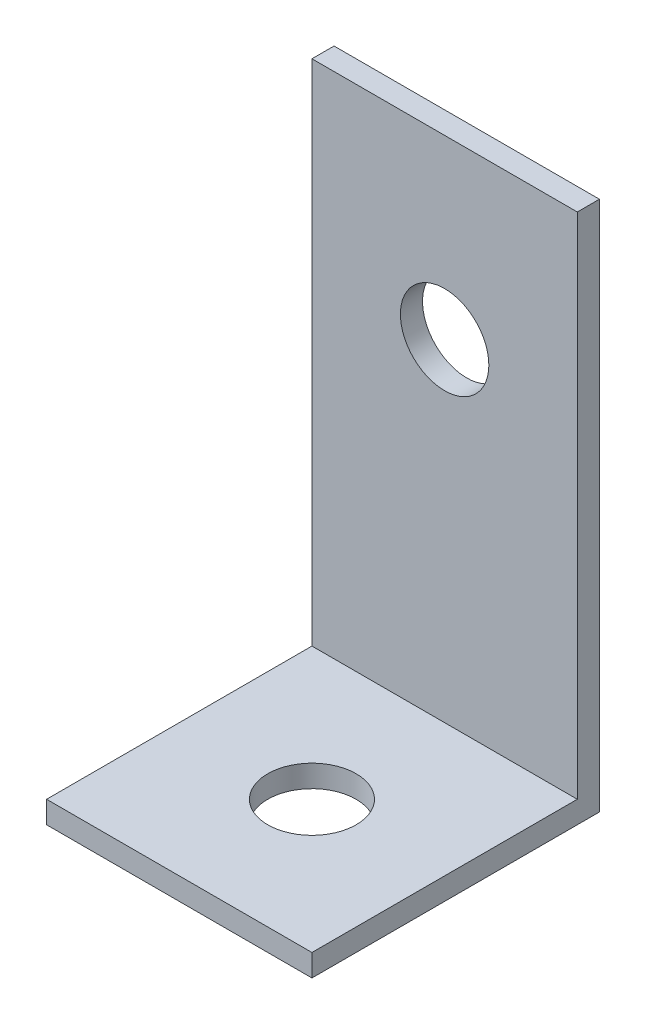
ISO-10303-21;
HEADER;
FILE_DESCRIPTION(('STEP AP214'),'2;1');
FILE_NAME('part.step','',(''),(''),'','','');
FILE_SCHEMA(('AUTOMOTIVE_DESIGN { 1 0 10303 214 1 1 1 1 }'));
ENDSEC;
DATA;
#1=APPLICATION_CONTEXT('core data for automotive mechanical design processes');
#2=APPLICATION_PROTOCOL_DEFINITION('international standard','automotive_design',2000,#1);
#3=PRODUCT_CONTEXT('',#1,'mechanical');
#4=PRODUCT('Part','Part','',(#3));
#5=PRODUCT_RELATED_PRODUCT_CATEGORY('part','',(#4));
#6=PRODUCT_DEFINITION_FORMATION('','',#4);
#7=PRODUCT_DEFINITION_CONTEXT('part definition',#1,'design');
#8=PRODUCT_DEFINITION('design','',#6,#7);
#9=PRODUCT_DEFINITION_SHAPE('','',#8);
#10=(LENGTH_UNIT() NAMED_UNIT(*) SI_UNIT(.MILLI.,.METRE.));
#11=(NAMED_UNIT(*) PLANE_ANGLE_UNIT() SI_UNIT($,.RADIAN.));
#12=(NAMED_UNIT(*) SI_UNIT($,.STERADIAN.) SOLID_ANGLE_UNIT());
#13=UNCERTAINTY_MEASURE_WITH_UNIT(LENGTH_MEASURE(1.E-05),#10,'distance_accuracy_value','');
#14=(GEOMETRIC_REPRESENTATION_CONTEXT(3) GLOBAL_UNCERTAINTY_ASSIGNED_CONTEXT((#13)) GLOBAL_UNIT_ASSIGNED_CONTEXT((#10,
#11,#12)) REPRESENTATION_CONTEXT('',''));
#15=CARTESIAN_POINT('',(0.,0.,0.));
#16=DIRECTION('',(0.,0.,1.));
#17=DIRECTION('',(1.,0.,0.));
#18=AXIS2_PLACEMENT_3D('',#15,#16,#17);
#19=CARTESIAN_POINT('',(0.,0.,0.79375));
#20=DIRECTION('',(0.,0.,1.));
#21=DIRECTION('',(1.,0.,0.));
#22=AXIS2_PLACEMENT_3D('',#19,#20,#21);
#23=PLANE('',#22);
#24=CARTESIAN_POINT('',(0.,6.35,0.79375));
#25=DIRECTION('',(0.,0.,1.));
#26=DIRECTION('',(1.,0.,0.));
#27=AXIS2_PLACEMENT_3D('',#24,#25,#26);
#28=CIRCLE('',#27,3.175);
#29=CARTESIAN_POINT('',(3.175,6.35,0.79375));
#30=VERTEX_POINT('',#29);
#31=EDGE_CURVE('E115',#30,#30,#28,.T.);
#32=ORIENTED_EDGE('',*,*,#31,.F.);
#33=EDGE_LOOP('',(#32));
#34=FACE_BOUND('',#33,.T.);
#35=DIRECTION('',(0.,-1.,0.));
#36=VECTOR('',#35,1.);
#37=CARTESIAN_POINT('',(-9.525,19.05,0.79375));
#38=LINE('',#37,#36);
#39=CARTESIAN_POINT('',(-9.525,19.05,0.79375));
#40=VERTEX_POINT('',#39);
#41=CARTESIAN_POINT('',(-9.52499999999999,-17.4625,0.79375));
#42=VERTEX_POINT('',#41);
#43=EDGE_CURVE('E109',#40,#42,#38,.T.);
#44=ORIENTED_EDGE('',*,*,#43,.T.);
#45=DIRECTION('',(1.,0.,0.));
#46=VECTOR('',#45,1.);
#47=CARTESIAN_POINT('',(-9.52499999999999,-17.4625,0.79375));
#48=LINE('',#47,#46);
#49=CARTESIAN_POINT('',(9.525,-17.4625,0.79375));
#50=VERTEX_POINT('',#49);
#51=EDGE_CURVE('E163',#42,#50,#48,.T.);
#52=ORIENTED_EDGE('',*,*,#51,.T.);
#53=DIRECTION('',(0.,1.,0.));
#54=VECTOR('',#53,1.);
#55=CARTESIAN_POINT('',(9.525,19.05,0.79375));
#56=LINE('',#55,#54);
#57=CARTESIAN_POINT('',(9.525,19.05,0.79375));
#58=VERTEX_POINT('',#57);
#59=EDGE_CURVE('E98',#50,#58,#56,.T.);
#60=ORIENTED_EDGE('',*,*,#59,.T.);
#61=DIRECTION('',(-1.,0.,0.));
#62=VECTOR('',#61,1.);
#63=CARTESIAN_POINT('',(-9.525,19.05,0.79375));
#64=LINE('',#63,#62);
#65=EDGE_CURVE('E64',#58,#40,#64,.T.);
#66=ORIENTED_EDGE('',*,*,#65,.T.);
#67=EDGE_LOOP('',(#44,#52,#60,#66));
#68=FACE_BOUND('',#67,.T.);
#69=ADVANCED_FACE('F39',(#34,#68),#23,.T.);
#70=CARTESIAN_POINT('',(0.,0.,-0.79375));
#71=DIRECTION('',(0.,0.,1.));
#72=DIRECTION('',(1.,0.,0.));
#73=AXIS2_PLACEMENT_3D('',#70,#71,#72);
#74=PLANE('',#73);
#75=DIRECTION('',(0.,1.,0.));
#76=VECTOR('',#75,1.);
#77=CARTESIAN_POINT('',(9.525,19.05,-0.79375));
#78=LINE('',#77,#76);
#79=CARTESIAN_POINT('',(9.525,-19.05,-0.79375));
#80=VERTEX_POINT('',#79);
#81=CARTESIAN_POINT('',(9.525,19.05,-0.79375));
#82=VERTEX_POINT('',#81);
#83=EDGE_CURVE('E104',#80,#82,#78,.T.);
#84=ORIENTED_EDGE('',*,*,#83,.F.);
#85=DIRECTION('',(1.,0.,0.));
#86=VECTOR('',#85,1.);
#87=CARTESIAN_POINT('',(-9.525,-19.05,-0.79375));
#88=LINE('',#87,#86);
#89=CARTESIAN_POINT('',(-9.525,-19.05,-0.79375));
#90=VERTEX_POINT('',#89);
#91=EDGE_CURVE('E84',#90,#80,#88,.T.);
#92=ORIENTED_EDGE('',*,*,#91,.F.);
#93=DIRECTION('',(0.,-1.,0.));
#94=VECTOR('',#93,1.);
#95=CARTESIAN_POINT('',(-9.525,19.05,-0.79375));
#96=LINE('',#95,#94);
#97=CARTESIAN_POINT('',(-9.525,19.05,-0.79375));
#98=VERTEX_POINT('',#97);
#99=EDGE_CURVE('E99',#98,#90,#96,.T.);
#100=ORIENTED_EDGE('',*,*,#99,.F.);
#101=DIRECTION('',(-1.,0.,0.));
#102=VECTOR('',#101,1.);
#103=CARTESIAN_POINT('',(-9.525,19.05,-0.79375));
#104=LINE('',#103,#102);
#105=EDGE_CURVE('E113',#82,#98,#104,.T.);
#106=ORIENTED_EDGE('',*,*,#105,.F.);
#107=EDGE_LOOP('',(#84,#92,#100,#106));
#108=FACE_BOUND('',#107,.T.);
#109=CARTESIAN_POINT('',(0.,6.35,-0.79375));
#110=DIRECTION('',(0.,0.,1.));
#111=DIRECTION('',(1.,0.,0.));
#112=AXIS2_PLACEMENT_3D('',#109,#110,#111);
#113=CIRCLE('',#112,3.175);
#114=CARTESIAN_POINT('',(3.175,6.35,-0.79375));
#115=VERTEX_POINT('',#114);
#116=EDGE_CURVE('E121',#115,#115,#113,.T.);
#117=ORIENTED_EDGE('',*,*,#116,.T.);
#118=EDGE_LOOP('',(#117));
#119=FACE_BOUND('',#118,.T.);
#120=ADVANCED_FACE('F111',(#108,#119),#74,.F.);
#121=CARTESIAN_POINT('',(9.525,19.05,0.79375));
#122=DIRECTION('',(-1.,0.,0.));
#123=DIRECTION('',(0.,-1.,0.));
#124=AXIS2_PLACEMENT_3D('',#121,#122,#123);
#125=PLANE('',#124);
#126=ORIENTED_EDGE('',*,*,#83,.T.);
#127=DIRECTION('',(0.,0.,-1.));
#128=VECTOR('',#127,1.);
#129=CARTESIAN_POINT('',(9.525,19.05,0.79375));
#130=LINE('',#129,#128);
#131=EDGE_CURVE('E11',#58,#82,#130,.T.);
#132=ORIENTED_EDGE('',*,*,#131,.F.);
#133=ORIENTED_EDGE('',*,*,#59,.F.);
#134=DIRECTION('',(0.,0.,1.));
#135=VECTOR('',#134,1.);
#136=CARTESIAN_POINT('',(9.525,-17.4625,0.79375));
#137=LINE('',#136,#135);
#138=CARTESIAN_POINT('',(9.525,-17.4625,19.84375));
#139=VERTEX_POINT('',#138);
#140=EDGE_CURVE('E55',#50,#139,#137,.T.);
#141=ORIENTED_EDGE('',*,*,#140,.T.);
#142=DIRECTION('',(0.,-1.,0.));
#143=VECTOR('',#142,1.);
#144=CARTESIAN_POINT('',(9.525,-17.4625,19.84375));
#145=LINE('',#144,#143);
#146=CARTESIAN_POINT('',(9.525,-19.05,19.84375));
#147=VERTEX_POINT('',#146);
#148=EDGE_CURVE('E106',#139,#147,#145,.T.);
#149=ORIENTED_EDGE('',*,*,#148,.T.);
#150=DIRECTION('',(0.,0.,-1.));
#151=VECTOR('',#150,1.);
#152=CARTESIAN_POINT('',(9.525,-19.05,0.79375));
#153=LINE('',#152,#151);
#154=EDGE_CURVE('E90',#147,#80,#153,.T.);
#155=ORIENTED_EDGE('',*,*,#154,.T.);
#156=EDGE_LOOP('',(#126,#132,#133,#141,#149,#155));
#157=FACE_BOUND('',#156,.T.);
#158=ADVANCED_FACE('F41',(#157),#125,.F.);
#159=CARTESIAN_POINT('',(-9.525,19.05,0.79375));
#160=DIRECTION('',(0.,-1.,0.));
#161=DIRECTION('',(0.,0.,-1.));
#162=AXIS2_PLACEMENT_3D('',#159,#160,#161);
#163=PLANE('',#162);
#164=ORIENTED_EDGE('',*,*,#105,.T.);
#165=DIRECTION('',(0.,0.,-1.));
#166=VECTOR('',#165,1.);
#167=CARTESIAN_POINT('',(-9.525,19.05,0.79375));
#168=LINE('',#167,#166);
#169=EDGE_CURVE('E48',#40,#98,#168,.T.);
#170=ORIENTED_EDGE('',*,*,#169,.F.);
#171=ORIENTED_EDGE('',*,*,#65,.F.);
#172=ORIENTED_EDGE('',*,*,#131,.T.);
#173=EDGE_LOOP('',(#164,#170,#171,#172));
#174=FACE_BOUND('',#173,.T.);
#175=ADVANCED_FACE('F136',(#174),#163,.F.);
#176=CARTESIAN_POINT('',(-9.525,19.05,0.79375));
#177=DIRECTION('',(1.,0.,0.));
#178=DIRECTION('',(0.,1.,0.));
#179=AXIS2_PLACEMENT_3D('',#176,#177,#178);
#180=PLANE('',#179);
#181=ORIENTED_EDGE('',*,*,#99,.T.);
#182=DIRECTION('',(0.,0.,-1.));
#183=VECTOR('',#182,1.);
#184=CARTESIAN_POINT('',(-9.525,-19.05,0.79375));
#185=LINE('',#184,#183);
#186=CARTESIAN_POINT('',(-9.525,-19.05,19.84375));
#187=VERTEX_POINT('',#186);
#188=EDGE_CURVE('E93',#187,#90,#185,.T.);
#189=ORIENTED_EDGE('',*,*,#188,.F.);
#190=DIRECTION('',(0.,-1.,0.));
#191=VECTOR('',#190,1.);
#192=CARTESIAN_POINT('',(-9.525,-17.4625,19.84375));
#193=LINE('',#192,#191);
#194=CARTESIAN_POINT('',(-9.525,-17.4625,19.84375));
#195=VERTEX_POINT('',#194);
#196=EDGE_CURVE('E145',#195,#187,#193,.T.);
#197=ORIENTED_EDGE('',*,*,#196,.F.);
#198=DIRECTION('',(0.,0.,-1.));
#199=VECTOR('',#198,1.);
#200=CARTESIAN_POINT('',(-9.52499999999999,-17.4625,0.79375));
#201=LINE('',#200,#199);
#202=EDGE_CURVE('E156',#195,#42,#201,.T.);
#203=ORIENTED_EDGE('',*,*,#202,.T.);
#204=ORIENTED_EDGE('',*,*,#43,.F.);
#205=ORIENTED_EDGE('',*,*,#169,.T.);
#206=EDGE_LOOP('',(#181,#189,#197,#203,#204,#205));
#207=FACE_BOUND('',#206,.T.);
#208=ADVANCED_FACE('F133',(#207),#180,.F.);
#209=CARTESIAN_POINT('',(-9.525,-19.05,0.79375));
#210=DIRECTION('',(0.,1.,0.));
#211=DIRECTION('',(0.,0.,1.));
#212=AXIS2_PLACEMENT_3D('',#209,#210,#211);
#213=PLANE('',#212);
#214=ORIENTED_EDGE('',*,*,#91,.T.);
#215=ORIENTED_EDGE('',*,*,#154,.F.);
#216=DIRECTION('',(-1.,0.,0.));
#217=VECTOR('',#216,1.);
#218=CARTESIAN_POINT('',(-9.525,-19.05,19.84375));
#219=LINE('',#218,#217);
#220=EDGE_CURVE('E153',#147,#187,#219,.T.);
#221=ORIENTED_EDGE('',*,*,#220,.T.);
#222=ORIENTED_EDGE('',*,*,#188,.T.);
#223=EDGE_LOOP('',(#214,#215,#221,#222));
#224=FACE_BOUND('',#223,.T.);
#225=CARTESIAN_POINT('',(0.,-19.05,10.31875));
#226=DIRECTION('',(0.,-1.,0.));
#227=DIRECTION('',(0.,0.,-1.));
#228=AXIS2_PLACEMENT_3D('',#225,#226,#227);
#229=CIRCLE('',#228,3.175);
#230=CARTESIAN_POINT('',(0.,-19.05,7.14375));
#231=VERTEX_POINT('',#230);
#232=EDGE_CURVE('E168',#231,#231,#229,.T.);
#233=ORIENTED_EDGE('',*,*,#232,.F.);
#234=EDGE_LOOP('',(#233));
#235=FACE_BOUND('',#234,.T.);
#236=ADVANCED_FACE('F86',(#224,#235),#213,.F.);
#237=CARTESIAN_POINT('',(0.,6.35,0.79375));
#238=DIRECTION('',(0.,0.,-1.));
#239=DIRECTION('',(-1.,0.,0.));
#240=AXIS2_PLACEMENT_3D('',#237,#238,#239);
#241=CYLINDRICAL_SURFACE('',#240,3.175);
#242=ORIENTED_EDGE('',*,*,#31,.T.);
#243=EDGE_LOOP('',(#242));
#244=FACE_BOUND('',#243,.T.);
#245=ORIENTED_EDGE('',*,*,#116,.F.);
#246=EDGE_LOOP('',(#245));
#247=FACE_BOUND('',#246,.T.);
#248=ADVANCED_FACE('F184',(#244,#247),#241,.F.);
#249=CARTESIAN_POINT('',(-9.525,-17.4625,19.84375));
#250=DIRECTION('',(0.,0.,1.));
#251=DIRECTION('',(1.,0.,0.));
#252=AXIS2_PLACEMENT_3D('',#249,#250,#251);
#253=PLANE('',#252);
#254=ORIENTED_EDGE('',*,*,#220,.F.);
#255=ORIENTED_EDGE('',*,*,#148,.F.);
#256=DIRECTION('',(-1.,0.,0.));
#257=VECTOR('',#256,1.);
#258=CARTESIAN_POINT('',(-9.525,-17.4625,19.84375));
#259=LINE('',#258,#257);
#260=EDGE_CURVE('E149',#139,#195,#259,.T.);
#261=ORIENTED_EDGE('',*,*,#260,.T.);
#262=ORIENTED_EDGE('',*,*,#196,.T.);
#263=EDGE_LOOP('',(#254,#255,#261,#262));
#264=FACE_BOUND('',#263,.T.);
#265=ADVANCED_FACE('F190',(#264),#253,.T.);
#266=CARTESIAN_POINT('',(0.,-17.4625,0.));
#267=DIRECTION('',(0.,1.,0.));
#268=DIRECTION('',(0.,0.,1.));
#269=AXIS2_PLACEMENT_3D('',#266,#267,#268);
#270=PLANE('',#269);
#271=CARTESIAN_POINT('',(0.,-17.4625,10.31875));
#272=DIRECTION('',(0.,-1.,0.));
#273=DIRECTION('',(0.,0.,-1.));
#274=AXIS2_PLACEMENT_3D('',#271,#272,#273);
#275=CIRCLE('',#274,3.175);
#276=CARTESIAN_POINT('',(0.,-17.4625,7.14375));
#277=VERTEX_POINT('',#276);
#278=EDGE_CURVE('E157',#277,#277,#275,.T.);
#279=ORIENTED_EDGE('',*,*,#278,.T.);
#280=EDGE_LOOP('',(#279));
#281=FACE_BOUND('',#280,.T.);
#282=ORIENTED_EDGE('',*,*,#202,.F.);
#283=ORIENTED_EDGE('',*,*,#260,.F.);
#284=ORIENTED_EDGE('',*,*,#140,.F.);
#285=ORIENTED_EDGE('',*,*,#51,.F.);
#286=EDGE_LOOP('',(#282,#283,#284,#285));
#287=FACE_BOUND('',#286,.T.);
#288=ADVANCED_FACE('F176',(#281,#287),#270,.T.);
#289=CARTESIAN_POINT('',(0.,-17.4625,10.31875));
#290=DIRECTION('',(0.,-1.,0.));
#291=DIRECTION('',(0.,0.,-1.));
#292=AXIS2_PLACEMENT_3D('',#289,#290,#291);
#293=CYLINDRICAL_SURFACE('',#292,3.175);
#294=ORIENTED_EDGE('',*,*,#278,.F.);
#295=EDGE_LOOP('',(#294));
#296=FACE_BOUND('',#295,.T.);
#297=ORIENTED_EDGE('',*,*,#232,.T.);
#298=EDGE_LOOP('',(#297));
#299=FACE_BOUND('',#298,.T.);
#300=ADVANCED_FACE('F178',(#296,#299),#293,.F.);
#301=CLOSED_SHELL('',(#69,#120,#158,#175,#208,#236,#248,#265,#288,#300));
#302=MANIFOLD_SOLID_BREP('B2',#301);
#303=ADVANCED_BREP_SHAPE_REPRESENTATION('',(#18,#302),#14);
#304=SHAPE_DEFINITION_REPRESENTATION(#9,#303);
ENDSEC;
END-ISO-10303-21;
